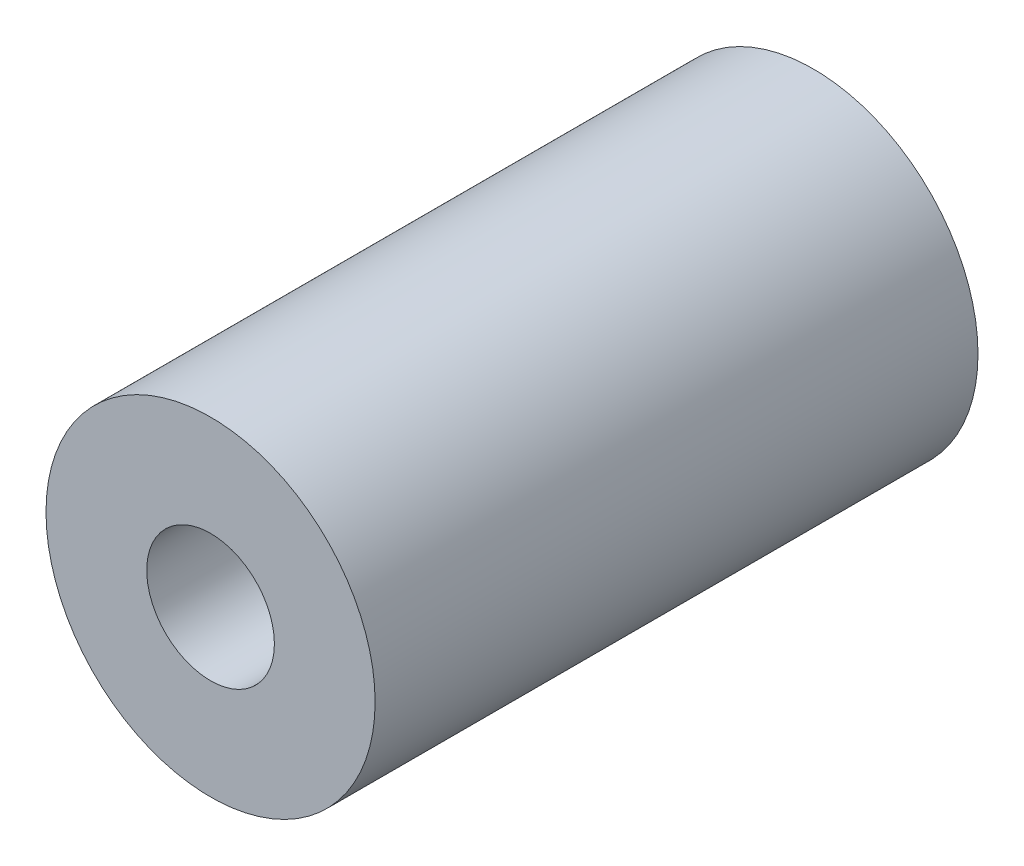
ISO-10303-21;
HEADER;
FILE_DESCRIPTION(('STEP AP214'),'2;1');
FILE_NAME('part.step','',(''),(''),'','','');
FILE_SCHEMA(('AUTOMOTIVE_DESIGN { 1 0 10303 214 1 1 1 1 }'));
ENDSEC;
DATA;
#1=APPLICATION_CONTEXT('core data for automotive mechanical design processes');
#2=APPLICATION_PROTOCOL_DEFINITION('international standard','automotive_design',2000,#1);
#3=PRODUCT_CONTEXT('',#1,'mechanical');
#4=PRODUCT('Part','Part','',(#3));
#5=PRODUCT_RELATED_PRODUCT_CATEGORY('part','',(#4));
#6=PRODUCT_DEFINITION_FORMATION('','',#4);
#7=PRODUCT_DEFINITION_CONTEXT('part definition',#1,'design');
#8=PRODUCT_DEFINITION('design','',#6,#7);
#9=PRODUCT_DEFINITION_SHAPE('','',#8);
#10=(LENGTH_UNIT() NAMED_UNIT(*) SI_UNIT(.MILLI.,.METRE.));
#11=(NAMED_UNIT(*) PLANE_ANGLE_UNIT() SI_UNIT($,.RADIAN.));
#12=(NAMED_UNIT(*) SI_UNIT($,.STERADIAN.) SOLID_ANGLE_UNIT());
#13=UNCERTAINTY_MEASURE_WITH_UNIT(LENGTH_MEASURE(1.E-05),#10,'distance_accuracy_value','');
#14=(GEOMETRIC_REPRESENTATION_CONTEXT(3) GLOBAL_UNCERTAINTY_ASSIGNED_CONTEXT((#13)) GLOBAL_UNIT_ASSIGNED_CONTEXT((#10,
#11,#12)) REPRESENTATION_CONTEXT('',''));
#15=CARTESIAN_POINT('',(0.,0.,0.));
#16=DIRECTION('',(0.,0.,1.));
#17=DIRECTION('',(1.,0.,0.));
#18=AXIS2_PLACEMENT_3D('',#15,#16,#17);
#19=CARTESIAN_POINT('',(0.,0.,85.));
#20=DIRECTION('',(0.,0.,1.));
#21=DIRECTION('',(1.,0.,0.));
#22=AXIS2_PLACEMENT_3D('',#19,#20,#21);
#23=PLANE('',#22);
#24=CARTESIAN_POINT('',(0.,0.,85.));
#25=DIRECTION('',(0.,0.,1.));
#26=DIRECTION('',(1.,0.,0.));
#27=AXIS2_PLACEMENT_3D('',#24,#25,#26);
#28=CIRCLE('',#27,23.2);
#29=CARTESIAN_POINT('',(23.2,0.,85.));
#30=VERTEX_POINT('',#29);
#31=EDGE_CURVE('E10',#30,#30,#28,.T.);
#32=ORIENTED_EDGE('',*,*,#31,.T.);
#33=EDGE_LOOP('',(#32));
#34=FACE_BOUND('',#33,.T.);
#35=CARTESIAN_POINT('',(0.,0.,85.));
#36=DIRECTION('',(0.,0.,1.));
#37=DIRECTION('',(1.,0.,0.));
#38=AXIS2_PLACEMENT_3D('',#35,#36,#37);
#39=CIRCLE('',#38,9.);
#40=CARTESIAN_POINT('',(9.,0.,85.));
#41=VERTEX_POINT('',#40);
#42=EDGE_CURVE('E48',#41,#41,#39,.T.);
#43=ORIENTED_EDGE('',*,*,#42,.F.);
#44=EDGE_LOOP('',(#43));
#45=FACE_BOUND('',#44,.T.);
#46=ADVANCED_FACE('F37',(#34,#45),#23,.T.);
#47=CARTESIAN_POINT('',(0.,0.,0.));
#48=DIRECTION('',(0.,0.,1.));
#49=DIRECTION('',(1.,0.,0.));
#50=AXIS2_PLACEMENT_3D('',#47,#48,#49);
#51=PLANE('',#50);
#52=CARTESIAN_POINT('',(0.,0.,0.));
#53=DIRECTION('',(0.,0.,1.));
#54=DIRECTION('',(1.,0.,0.));
#55=AXIS2_PLACEMENT_3D('',#52,#53,#54);
#56=CIRCLE('',#55,23.2);
#57=CARTESIAN_POINT('',(23.2,0.,0.));
#58=VERTEX_POINT('',#57);
#59=EDGE_CURVE('E41',#58,#58,#56,.T.);
#60=ORIENTED_EDGE('',*,*,#59,.F.);
#61=EDGE_LOOP('',(#60));
#62=FACE_BOUND('',#61,.T.);
#63=CARTESIAN_POINT('',(0.,0.,0.));
#64=DIRECTION('',(0.,0.,1.));
#65=DIRECTION('',(1.,0.,0.));
#66=AXIS2_PLACEMENT_3D('',#63,#64,#65);
#67=CIRCLE('',#66,9.);
#68=CARTESIAN_POINT('',(9.,0.,0.));
#69=VERTEX_POINT('',#68);
#70=EDGE_CURVE('E50',#69,#69,#67,.T.);
#71=ORIENTED_EDGE('',*,*,#70,.T.);
#72=EDGE_LOOP('',(#71));
#73=FACE_BOUND('',#72,.T.);
#74=ADVANCED_FACE('F60',(#62,#73),#51,.F.);
#75=CARTESIAN_POINT('',(0.,0.,85.));
#76=DIRECTION('',(0.,0.,-1.));
#77=DIRECTION('',(-1.,0.,0.));
#78=AXIS2_PLACEMENT_3D('',#75,#76,#77);
#79=CYLINDRICAL_SURFACE('',#78,23.2);
#80=ORIENTED_EDGE('',*,*,#31,.F.);
#81=EDGE_LOOP('',(#80));
#82=FACE_BOUND('',#81,.T.);
#83=ORIENTED_EDGE('',*,*,#59,.T.);
#84=EDGE_LOOP('',(#83));
#85=FACE_BOUND('',#84,.T.);
#86=ADVANCED_FACE('F39',(#82,#85),#79,.T.);
#87=CARTESIAN_POINT('',(0.,0.,85.));
#88=DIRECTION('',(0.,0.,-1.));
#89=DIRECTION('',(-1.,0.,0.));
#90=AXIS2_PLACEMENT_3D('',#87,#88,#89);
#91=CYLINDRICAL_SURFACE('',#90,9.);
#92=ORIENTED_EDGE('',*,*,#42,.T.);
#93=EDGE_LOOP('',(#92));
#94=FACE_BOUND('',#93,.T.);
#95=ORIENTED_EDGE('',*,*,#70,.F.);
#96=EDGE_LOOP('',(#95));
#97=FACE_BOUND('',#96,.T.);
#98=ADVANCED_FACE('F56',(#94,#97),#91,.F.);
#99=CLOSED_SHELL('',(#46,#74,#86,#98));
#100=MANIFOLD_SOLID_BREP('B2',#99);
#101=ADVANCED_BREP_SHAPE_REPRESENTATION('',(#18,#100),#14);
#102=SHAPE_DEFINITION_REPRESENTATION(#9,#101);
ENDSEC;
END-ISO-10303-21;
